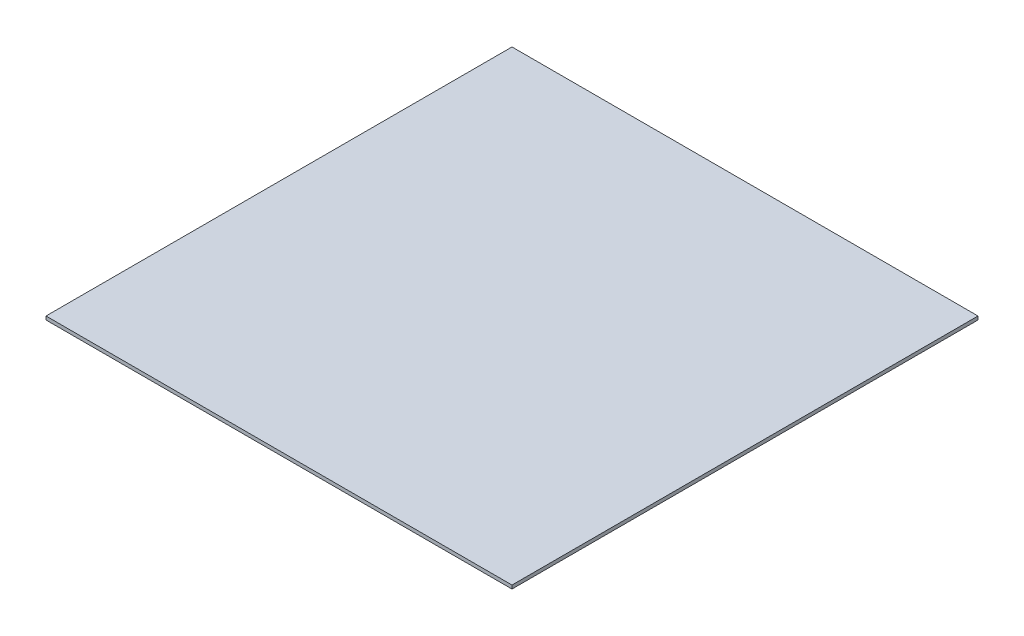
ISO-10303-21;
HEADER;
FILE_DESCRIPTION(('STEP AP214'),'2;1');
FILE_NAME('part.step','',(''),(''),'','','');
FILE_SCHEMA(('AUTOMOTIVE_DESIGN { 1 0 10303 214 1 1 1 1 }'));
ENDSEC;
DATA;
#1=APPLICATION_CONTEXT('core data for automotive mechanical design processes');
#2=APPLICATION_PROTOCOL_DEFINITION('international standard','automotive_design',2000,#1);
#3=PRODUCT_CONTEXT('',#1,'mechanical');
#4=PRODUCT('Part','Part','',(#3));
#5=PRODUCT_RELATED_PRODUCT_CATEGORY('part','',(#4));
#6=PRODUCT_DEFINITION_FORMATION('','',#4);
#7=PRODUCT_DEFINITION_CONTEXT('part definition',#1,'design');
#8=PRODUCT_DEFINITION('design','',#6,#7);
#9=PRODUCT_DEFINITION_SHAPE('','',#8);
#10=(LENGTH_UNIT() NAMED_UNIT(*) SI_UNIT(.MILLI.,.METRE.));
#11=(NAMED_UNIT(*) PLANE_ANGLE_UNIT() SI_UNIT($,.RADIAN.));
#12=(NAMED_UNIT(*) SI_UNIT($,.STERADIAN.) SOLID_ANGLE_UNIT());
#13=UNCERTAINTY_MEASURE_WITH_UNIT(LENGTH_MEASURE(1.E-05),#10,'distance_accuracy_value','');
#14=(GEOMETRIC_REPRESENTATION_CONTEXT(3) GLOBAL_UNCERTAINTY_ASSIGNED_CONTEXT((#13)) GLOBAL_UNIT_ASSIGNED_CONTEXT((#10,
#11,#12)) REPRESENTATION_CONTEXT('',''));
#15=CARTESIAN_POINT('',(0.,0.,0.));
#16=DIRECTION('',(0.,0.,1.));
#17=DIRECTION('',(1.,0.,0.));
#18=AXIS2_PLACEMENT_3D('',#15,#16,#17);
#19=CARTESIAN_POINT('',(200.,3.,-200.));
#20=DIRECTION('',(-1.,0.,0.));
#21=DIRECTION('',(0.,0.,1.));
#22=AXIS2_PLACEMENT_3D('',#19,#20,#21);
#23=PLANE('',#22);
#24=DIRECTION('',(0.,0.,-1.));
#25=VECTOR('',#24,1.);
#26=CARTESIAN_POINT('',(200.,0.,-200.));
#27=LINE('',#26,#25);
#28=CARTESIAN_POINT('',(200.,0.,200.));
#29=VERTEX_POINT('',#28);
#30=CARTESIAN_POINT('',(200.,0.,-200.));
#31=VERTEX_POINT('',#30);
#32=EDGE_CURVE('E97',#29,#31,#27,.T.);
#33=ORIENTED_EDGE('',*,*,#32,.T.);
#34=DIRECTION('',(0.,-1.,0.));
#35=VECTOR('',#34,1.);
#36=CARTESIAN_POINT('',(200.,3.,-200.));
#37=LINE('',#36,#35);
#38=CARTESIAN_POINT('',(200.,3.,-200.));
#39=VERTEX_POINT('',#38);
#40=EDGE_CURVE('E11',#39,#31,#37,.T.);
#41=ORIENTED_EDGE('',*,*,#40,.F.);
#42=DIRECTION('',(0.,0.,-1.));
#43=VECTOR('',#42,1.);
#44=CARTESIAN_POINT('',(200.,3.,-200.));
#45=LINE('',#44,#43);
#46=CARTESIAN_POINT('',(200.,3.,200.));
#47=VERTEX_POINT('',#46);
#48=EDGE_CURVE('E85',#47,#39,#45,.T.);
#49=ORIENTED_EDGE('',*,*,#48,.F.);
#50=DIRECTION('',(0.,-1.,0.));
#51=VECTOR('',#50,1.);
#52=CARTESIAN_POINT('',(200.,3.,200.));
#53=LINE('',#52,#51);
#54=EDGE_CURVE('E93',#47,#29,#53,.T.);
#55=ORIENTED_EDGE('',*,*,#54,.T.);
#56=EDGE_LOOP('',(#33,#41,#49,#55));
#57=FACE_BOUND('',#56,.T.);
#58=ADVANCED_FACE('F34',(#57),#23,.F.);
#59=CARTESIAN_POINT('',(-200.,3.,-200.));
#60=DIRECTION('',(0.,0.,1.));
#61=DIRECTION('',(1.,0.,0.));
#62=AXIS2_PLACEMENT_3D('',#59,#60,#61);
#63=PLANE('',#62);
#64=DIRECTION('',(-1.,0.,0.));
#65=VECTOR('',#64,1.);
#66=CARTESIAN_POINT('',(-200.,0.,-200.));
#67=LINE('',#66,#65);
#68=CARTESIAN_POINT('',(-200.,0.,-200.));
#69=VERTEX_POINT('',#68);
#70=EDGE_CURVE('E89',#31,#69,#67,.T.);
#71=ORIENTED_EDGE('',*,*,#70,.T.);
#72=DIRECTION('',(0.,-1.,0.));
#73=VECTOR('',#72,1.);
#74=CARTESIAN_POINT('',(-200.,3.,-200.));
#75=LINE('',#74,#73);
#76=CARTESIAN_POINT('',(-200.,3.,-200.));
#77=VERTEX_POINT('',#76);
#78=EDGE_CURVE('E42',#77,#69,#75,.T.);
#79=ORIENTED_EDGE('',*,*,#78,.F.);
#80=DIRECTION('',(-1.,0.,0.));
#81=VECTOR('',#80,1.);
#82=CARTESIAN_POINT('',(-200.,3.,-200.));
#83=LINE('',#82,#81);
#84=EDGE_CURVE('E80',#39,#77,#83,.T.);
#85=ORIENTED_EDGE('',*,*,#84,.F.);
#86=ORIENTED_EDGE('',*,*,#40,.T.);
#87=EDGE_LOOP('',(#71,#79,#85,#86));
#88=FACE_BOUND('',#87,.T.);
#89=ADVANCED_FACE('F88',(#88),#63,.F.);
#90=CARTESIAN_POINT('',(-200.,3.,-200.));
#91=DIRECTION('',(1.,0.,0.));
#92=DIRECTION('',(0.,0.,-1.));
#93=AXIS2_PLACEMENT_3D('',#90,#91,#92);
#94=PLANE('',#93);
#95=DIRECTION('',(0.,0.,1.));
#96=VECTOR('',#95,1.);
#97=CARTESIAN_POINT('',(-200.,0.,-200.));
#98=LINE('',#97,#96);
#99=CARTESIAN_POINT('',(-200.,0.,200.));
#100=VERTEX_POINT('',#99);
#101=EDGE_CURVE('E67',#69,#100,#98,.T.);
#102=ORIENTED_EDGE('',*,*,#101,.T.);
#103=DIRECTION('',(0.,-1.,0.));
#104=VECTOR('',#103,1.);
#105=CARTESIAN_POINT('',(-200.,3.,200.));
#106=LINE('',#105,#104);
#107=CARTESIAN_POINT('',(-200.,3.,200.));
#108=VERTEX_POINT('',#107);
#109=EDGE_CURVE('E90',#108,#100,#106,.T.);
#110=ORIENTED_EDGE('',*,*,#109,.F.);
#111=DIRECTION('',(0.,0.,1.));
#112=VECTOR('',#111,1.);
#113=CARTESIAN_POINT('',(-200.,3.,-200.));
#114=LINE('',#113,#112);
#115=EDGE_CURVE('E83',#77,#108,#114,.T.);
#116=ORIENTED_EDGE('',*,*,#115,.F.);
#117=ORIENTED_EDGE('',*,*,#78,.T.);
#118=EDGE_LOOP('',(#102,#110,#116,#117));
#119=FACE_BOUND('',#118,.T.);
#120=ADVANCED_FACE('F91',(#119),#94,.F.);
#121=CARTESIAN_POINT('',(-200.,3.,200.));
#122=DIRECTION('',(0.,0.,-1.));
#123=DIRECTION('',(-1.,0.,0.));
#124=AXIS2_PLACEMENT_3D('',#121,#122,#123);
#125=PLANE('',#124);
#126=DIRECTION('',(1.,0.,0.));
#127=VECTOR('',#126,1.);
#128=CARTESIAN_POINT('',(-200.,0.,200.));
#129=LINE('',#128,#127);
#130=EDGE_CURVE('E73',#100,#29,#129,.T.);
#131=ORIENTED_EDGE('',*,*,#130,.T.);
#132=ORIENTED_EDGE('',*,*,#54,.F.);
#133=DIRECTION('',(1.,0.,0.));
#134=VECTOR('',#133,1.);
#135=CARTESIAN_POINT('',(-200.,3.,200.));
#136=LINE('',#135,#134);
#137=EDGE_CURVE('E50',#108,#47,#136,.T.);
#138=ORIENTED_EDGE('',*,*,#137,.F.);
#139=ORIENTED_EDGE('',*,*,#109,.T.);
#140=EDGE_LOOP('',(#131,#132,#138,#139));
#141=FACE_BOUND('',#140,.T.);
#142=ADVANCED_FACE('F104',(#141),#125,.F.);
#143=CARTESIAN_POINT('',(0.,3.,0.));
#144=DIRECTION('',(0.,1.,0.));
#145=DIRECTION('',(0.,0.,1.));
#146=AXIS2_PLACEMENT_3D('',#143,#144,#145);
#147=PLANE('',#146);
#148=ORIENTED_EDGE('',*,*,#48,.T.);
#149=ORIENTED_EDGE('',*,*,#84,.T.);
#150=ORIENTED_EDGE('',*,*,#115,.T.);
#151=ORIENTED_EDGE('',*,*,#137,.T.);
#152=EDGE_LOOP('',(#148,#149,#150,#151));
#153=FACE_BOUND('',#152,.T.);
#154=ADVANCED_FACE('F81',(#153),#147,.T.);
#155=CARTESIAN_POINT('',(0.,0.,0.));
#156=DIRECTION('',(0.,1.,0.));
#157=DIRECTION('',(0.,0.,1.));
#158=AXIS2_PLACEMENT_3D('',#155,#156,#157);
#159=PLANE('',#158);
#160=ORIENTED_EDGE('',*,*,#32,.F.);
#161=ORIENTED_EDGE('',*,*,#130,.F.);
#162=ORIENTED_EDGE('',*,*,#101,.F.);
#163=ORIENTED_EDGE('',*,*,#70,.F.);
#164=EDGE_LOOP('',(#160,#161,#162,#163));
#165=FACE_BOUND('',#164,.T.);
#166=ADVANCED_FACE('F107',(#165),#159,.F.);
#167=CLOSED_SHELL('',(#58,#89,#120,#142,#154,#166));
#168=MANIFOLD_SOLID_BREP('B2',#167);
#169=ADVANCED_BREP_SHAPE_REPRESENTATION('',(#18,#168),#14);
#170=SHAPE_DEFINITION_REPRESENTATION(#9,#169);
ENDSEC;
END-ISO-10303-21;
